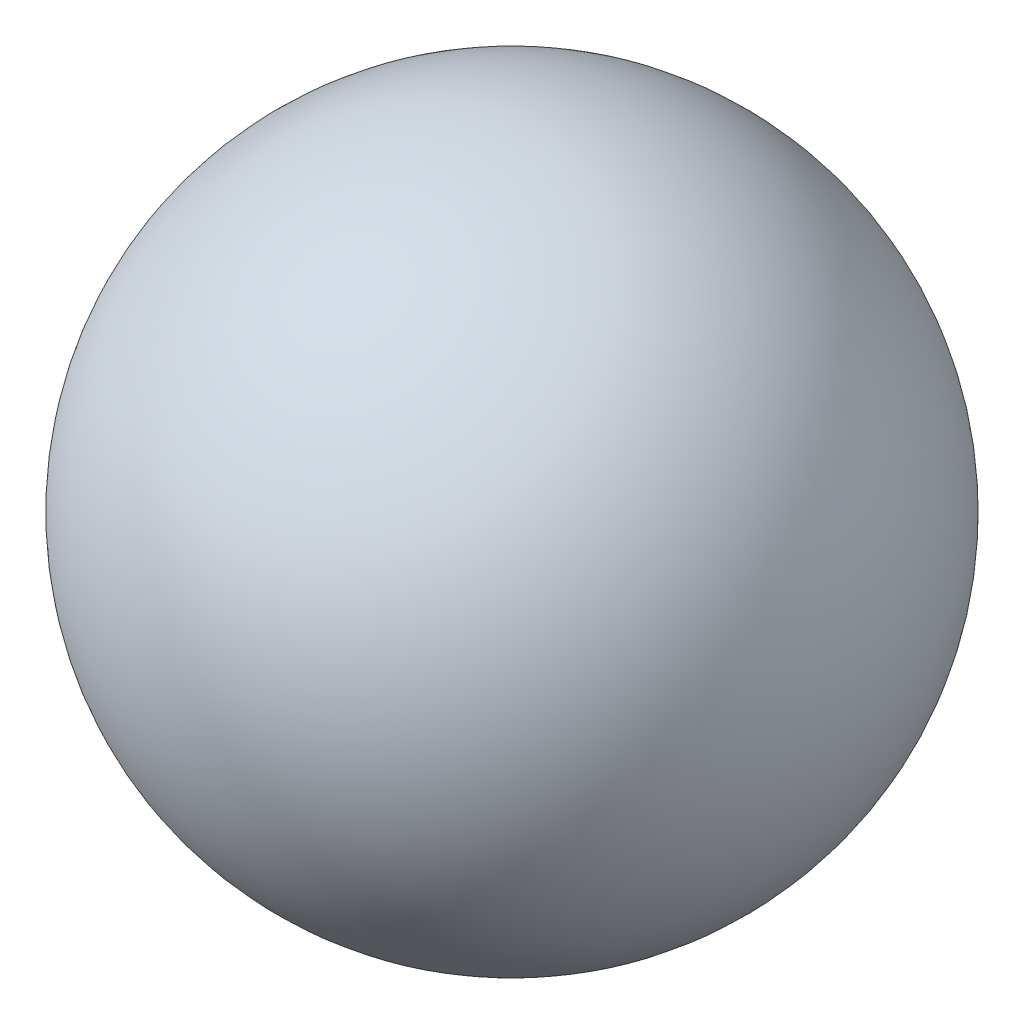
ISO-10303-21;
HEADER;
FILE_DESCRIPTION(('STEP AP214'),'2;1');
FILE_NAME('part.step','',(''),(''),'','','');
FILE_SCHEMA(('AUTOMOTIVE_DESIGN { 1 0 10303 214 1 1 1 1 }'));
ENDSEC;
DATA;
#1=APPLICATION_CONTEXT('core data for automotive mechanical design processes');
#2=APPLICATION_PROTOCOL_DEFINITION('international standard','automotive_design',2000,#1);
#3=PRODUCT_CONTEXT('',#1,'mechanical');
#4=PRODUCT('Part','Part','',(#3));
#5=PRODUCT_RELATED_PRODUCT_CATEGORY('part','',(#4));
#6=PRODUCT_DEFINITION_FORMATION('','',#4);
#7=PRODUCT_DEFINITION_CONTEXT('part definition',#1,'design');
#8=PRODUCT_DEFINITION('design','',#6,#7);
#9=PRODUCT_DEFINITION_SHAPE('','',#8);
#10=(LENGTH_UNIT() NAMED_UNIT(*) SI_UNIT(.MILLI.,.METRE.));
#11=(NAMED_UNIT(*) PLANE_ANGLE_UNIT() SI_UNIT($,.RADIAN.));
#12=(NAMED_UNIT(*) SI_UNIT($,.STERADIAN.) SOLID_ANGLE_UNIT());
#13=UNCERTAINTY_MEASURE_WITH_UNIT(LENGTH_MEASURE(1.E-05),#10,'distance_accuracy_value','');
#14=(GEOMETRIC_REPRESENTATION_CONTEXT(3) GLOBAL_UNCERTAINTY_ASSIGNED_CONTEXT((#13)) GLOBAL_UNIT_ASSIGNED_CONTEXT((#10,
#11,#12)) REPRESENTATION_CONTEXT('',''));
#15=CARTESIAN_POINT('',(0.,0.,0.));
#16=DIRECTION('',(0.,0.,1.));
#17=DIRECTION('',(1.,0.,0.));
#18=AXIS2_PLACEMENT_3D('',#15,#16,#17);
#19=CARTESIAN_POINT('',(0.,18.5,0.));
#20=DIRECTION('',(0.,-1.,0.));
#21=DIRECTION('',(-1.,0.,0.));
#22=AXIS2_PLACEMENT_3D('',#19,#20,#21);
#23=SPHERICAL_SURFACE('',#22,2.);
#24=CARTESIAN_POINT('',(0.,16.5,0.));
#25=VERTEX_POINT('',#24);
#26=VERTEX_LOOP('',#25);
#27=FACE_BOUND('',#26,.T.);
#28=ADVANCED_FACE('F22',(#27),#23,.T.);
#29=CLOSED_SHELL('',(#28));
#30=MANIFOLD_SOLID_BREP('B2',#29);
#31=ADVANCED_BREP_SHAPE_REPRESENTATION('',(#18,#30),#14);
#32=SHAPE_DEFINITION_REPRESENTATION(#9,#31);
ENDSEC;
END-ISO-10303-21;
